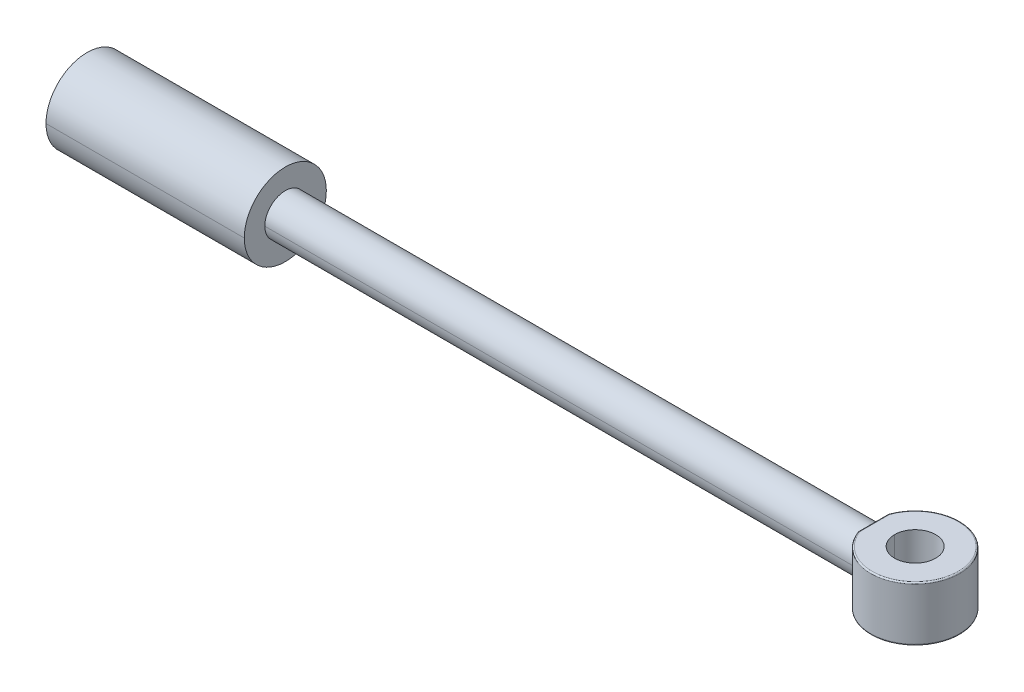
ISO-10303-21;
HEADER;
FILE_DESCRIPTION(('STEP AP214'),'2;1');
FILE_NAME('part.step','',(''),(''),'','','');
FILE_SCHEMA(('AUTOMOTIVE_DESIGN { 1 0 10303 214 1 1 1 1 }'));
ENDSEC;
DATA;
#1=APPLICATION_CONTEXT('core data for automotive mechanical design processes');
#2=APPLICATION_PROTOCOL_DEFINITION('international standard','automotive_design',2000,#1);
#3=PRODUCT_CONTEXT('',#1,'mechanical');
#4=PRODUCT('Part','Part','',(#3));
#5=PRODUCT_RELATED_PRODUCT_CATEGORY('part','',(#4));
#6=PRODUCT_DEFINITION_FORMATION('','',#4);
#7=PRODUCT_DEFINITION_CONTEXT('part definition',#1,'design');
#8=PRODUCT_DEFINITION('design','',#6,#7);
#9=PRODUCT_DEFINITION_SHAPE('','',#8);
#10=(LENGTH_UNIT() NAMED_UNIT(*) SI_UNIT(.MILLI.,.METRE.));
#11=(NAMED_UNIT(*) PLANE_ANGLE_UNIT() SI_UNIT($,.RADIAN.));
#12=(NAMED_UNIT(*) SI_UNIT($,.STERADIAN.) SOLID_ANGLE_UNIT());
#13=UNCERTAINTY_MEASURE_WITH_UNIT(LENGTH_MEASURE(1.E-05),#10,'distance_accuracy_value','');
#14=(GEOMETRIC_REPRESENTATION_CONTEXT(3) GLOBAL_UNCERTAINTY_ASSIGNED_CONTEXT((#13)) GLOBAL_UNIT_ASSIGNED_CONTEXT((#10,
#11,#12)) REPRESENTATION_CONTEXT('',''));
#15=CARTESIAN_POINT('',(0.,0.,0.));
#16=DIRECTION('',(0.,0.,1.));
#17=DIRECTION('',(1.,0.,0.));
#18=AXIS2_PLACEMENT_3D('',#15,#16,#17);
#19=CARTESIAN_POINT('',(-28.75,0.,0.));
#20=DIRECTION('',(-1.,0.,0.));
#21=DIRECTION('',(0.,0.,1.));
#22=AXIS2_PLACEMENT_3D('',#19,#20,#21);
#23=CYLINDRICAL_SURFACE('',#22,15.);
#24=CARTESIAN_POINT('',(145.,0.,0.));
#25=DIRECTION('',(1.,0.,0.));
#26=DIRECTION('',(0.,0.,-1.));
#27=AXIS2_PLACEMENT_3D('',#24,#25,#26);
#28=CIRCLE('',#27,15.);
#29=CARTESIAN_POINT('',(145.,0.,-15.));
#30=VERTEX_POINT('',#29);
#31=CARTESIAN_POINT('',(145.,0.,15.));
#32=VERTEX_POINT('',#31);
#33=EDGE_CURVE('E11',#30,#32,#28,.T.);
#34=ORIENTED_EDGE('',*,*,#33,.T.);
#35=DIRECTION('',(-1.,0.,0.));
#36=VECTOR('',#35,1.);
#37=CARTESIAN_POINT('',(575.,0.,15.));
#38=LINE('',#37,#36);
#39=CARTESIAN_POINT('',(575.,0.,15.));
#40=VERTEX_POINT('',#39);
#41=EDGE_CURVE('E36',#40,#32,#38,.T.);
#42=ORIENTED_EDGE('',*,*,#41,.F.);
#43=CARTESIAN_POINT('',(575.,0.,0.));
#44=DIRECTION('',(1.,0.,0.));
#45=DIRECTION('',(0.,0.,1.));
#46=AXIS2_PLACEMENT_3D('',#43,#44,#45);
#47=CIRCLE('',#46,15.);
#48=CARTESIAN_POINT('',(575.015079365079,-10.2095472140301,10.9887787441043));
#49=VERTEX_POINT('',#48);
#50=EDGE_CURVE('E27',#40,#49,#47,.T.);
#51=ORIENTED_EDGE('',*,*,#50,.T.);
#52=CARTESIAN_POINT('',(575.018438811269,10.1986326040488,11.0008233900868));
#53=CARTESIAN_POINT('',(575.075798920642,10.0274698699406,11.1602881987124));
#54=CARTESIAN_POINT('',(575.133137902024,9.85256924967932,11.3157633117448));
#55=CARTESIAN_POINT('',(575.246745966509,9.49701994937464,11.6170401892811));
#56=CARTESIAN_POINT('',(575.303020008204,9.31643345842196,11.7629135017409));
#57=CARTESIAN_POINT('',(575.414104751249,8.9495126168481,12.045106227894));
#58=CARTESIAN_POINT('',(575.468922666446,8.76322414862832,12.1814824182651));
#59=CARTESIAN_POINT('',(575.576730564212,8.38492059894139,12.4448158253612));
#60=CARTESIAN_POINT('',(575.62972773582,8.19293546825972,12.5718131170147));
#61=CARTESIAN_POINT('',(575.733557070786,7.80325296608626,12.816521112503));
#62=CARTESIAN_POINT('',(575.784394198618,7.60557066631598,12.9342537075953));
#63=CARTESIAN_POINT('',(575.883595832953,7.20451077451255,13.1605693253251));
#64=CARTESIAN_POINT('',(575.931961043149,7.00113482912161,13.2691549576417));
#65=CARTESIAN_POINT('',(576.025931121516,6.58869410358599,13.4772963825114));
#66=CARTESIAN_POINT('',(576.071530645685,6.37961937467375,13.5768348677401));
#67=CARTESIAN_POINT('',(576.159734174569,5.95581739838218,13.7670542388325));
#68=CARTESIAN_POINT('',(576.202325415078,5.74107082396903,13.8576979507668));
#69=CARTESIAN_POINT('',(576.285071287346,5.30122950259649,14.0319097920815));
#70=CARTESIAN_POINT('',(576.32512736043,5.07601238549925,14.1152164537577));
#71=CARTESIAN_POINT('',(576.400396803402,4.62396840867151,14.27026709777));
#72=CARTESIAN_POINT('',(576.435663201343,4.39719454204586,14.3421395211247));
#73=CARTESIAN_POINT('',(576.501133006099,3.94207707737367,14.4745064388244));
#74=CARTESIAN_POINT('',(576.531382566648,3.71377053676567,14.5351053595846));
#75=CARTESIAN_POINT('',(576.586613067861,3.25559753701131,14.6450380435408));
#76=CARTESIAN_POINT('',(576.611630534816,3.02575430582071,14.6944501192635));
#77=CARTESIAN_POINT('',(576.656240057104,2.56452331975277,14.7821233295087));
#78=CARTESIAN_POINT('',(576.67585634319,2.33314739493436,14.82043430768));
#79=CARTESIAN_POINT('',(576.709545546693,1.86886180753317,14.8860001024671));
#80=CARTESIAN_POINT('',(576.723628428401,1.63595567688543,14.9132747953668));
#81=CARTESIAN_POINT('',(576.746172195411,1.16861727056746,14.9568453916648));
#82=CARTESIAN_POINT('',(576.754627548025,0.934183721139947,14.9731304908948));
#83=CARTESIAN_POINT('',(576.765878561865,0.463795941617146,14.9947854289824));
#84=CARTESIAN_POINT('',(576.768652800798,0.227839309038401,15.0001139531939));
#85=CARTESIAN_POINT('',(576.768531974112,-0.243900107829193,14.9998817187552));
#86=CARTESIAN_POINT('',(576.765640926716,-0.479682896763271,14.9943286780833));
#87=CARTESIAN_POINT('',(576.754153011372,-0.949756441982427,14.972216479084));
#88=CARTESIAN_POINT('',(576.745576433151,-1.18404952360615,14.9556964578824));
#89=CARTESIAN_POINT('',(576.722791837089,-1.65114069512522,14.911655246294));
#90=CARTESIAN_POINT('',(576.708588190029,-1.8839398031702,14.8841425942037));
#91=CARTESIAN_POINT('',(576.67465885847,-2.34804522188321,14.8180976940989));
#92=CARTESIAN_POINT('',(576.654922078424,-2.57934756763726,14.7795433007817));
#93=CARTESIAN_POINT('',(576.610074030993,-3.04046540050818,14.6913800684913));
#94=CARTESIAN_POINT('',(576.584937478118,-3.27026846244826,14.6417191745752));
#95=CARTESIAN_POINT('',(576.529472222423,-3.72839549253074,14.5312854652698));
#96=CARTESIAN_POINT('',(576.499106055375,-3.95669550542119,14.4704322394598));
#97=CARTESIAN_POINT('',(576.433406496685,-4.41183363102603,14.3375511518726));
#98=CARTESIAN_POINT('',(576.398026154575,-4.63863385803879,14.2654169099561));
#99=CARTESIAN_POINT('',(576.32253613117,-5.09076730271133,14.109842832453));
#100=CARTESIAN_POINT('',(576.282372826069,-5.31604667976751,14.0262728608104));
#101=CARTESIAN_POINT('',(576.199461666468,-5.75578037465077,13.8516224323595));
#102=CARTESIAN_POINT('',(576.156815784953,-5.97036184031047,13.7608130378694));
#103=CARTESIAN_POINT('',(576.068501699319,-6.39384242984147,13.5702466258172));
#104=CARTESIAN_POINT('',(576.022845911494,-6.60276042786405,13.4705258293378));
#105=CARTESIAN_POINT('',(575.928765774727,-7.01489969305625,13.2620101946963));
#106=CARTESIAN_POINT('',(575.880346445324,-7.21813034855356,13.1532316532706));
#107=CARTESIAN_POINT('',(575.781039045723,-7.61891093771196,12.9265187741344));
#108=CARTESIAN_POINT('',(575.730150001187,-7.81645857958032,12.8085808117078));
#109=CARTESIAN_POINT('',(575.626220365308,-8.20588334404369,12.5634508842878));
#110=CARTESIAN_POINT('',(575.573174605357,-8.39774467611243,12.4362360287037));
#111=CARTESIAN_POINT('',(575.465273895591,-8.77581221831775,12.1724559657881));
#112=CARTESIAN_POINT('',(575.410411630418,-8.96198770245309,12.0358497218362));
#113=CARTESIAN_POINT('',(575.299243542481,-9.32869422807096,11.7531852215973));
#114=CARTESIAN_POINT('',(575.242930465757,-9.50917857527334,11.6070692842641));
#115=CARTESIAN_POINT('',(575.129250593602,-9.86453528355088,11.3052951869491));
#116=CARTESIAN_POINT('',(575.071878888906,-10.0393446310425,11.149564647575));
#117=CARTESIAN_POINT('',(575.014492974546,-10.2104136573085,10.9898480424391));
#118=B_SPLINE_CURVE_WITH_KNOTS('',3,(#52,#53,#54,#55,#56,#57,#58,#59,#60,#61,#62,#63,#64,#65,
#66,#67,#68,#69,#70,#71,#72,#73,#74,#75,#76,#77,#78,#79,#80,#81,#82,#83,#84,#85,#86,#87,#88,#89,
#90,#91,#92,#93,#94,#95,#96,#97,#98,#99,#100,#101,#102,#103,#104,#105,#106,#107,#108,#109,#110,
#111,#112,#113,#114,#115,#116,#117),.UNSPECIFIED.,.F.,.F.,(4,2,2,2,2,2,2,2,2,2,2,2,2,2,2,2,2,2,
2,2,2,2,2,2,2,2,2,2,2,2,2,2,4),(0.,0.722547232320676,1.43889540713049,2.15050862212376,
2.85888034840113,3.56552462237561,4.27196659912319,4.97973275247182,5.69034103291579,
6.42039312866351,7.14155576841832,7.85566364752814,8.56460625012201,9.27031456303919,
9.97474618112489,10.6798693400554,11.3876465112472,12.0949218583278,12.7996866708127,
13.5039051328269,14.2095459858414,14.9185661152179,15.6328946245843,16.354418028223,
17.0849670893348,17.7953462076839,18.5029589571285,19.2093249921998,19.9159720005009,
20.6244258409789,21.3362007407592,22.0527898615119,22.775656519347),.UNSPECIFIED.);
#119=CARTESIAN_POINT('',(575.020365569891,10.1979308562441,10.9994214652227));
#120=VERTEX_POINT('',#119);
#121=EDGE_CURVE('E206',#120,#49,#118,.T.);
#122=ORIENTED_EDGE('',*,*,#121,.F.);
#123=CARTESIAN_POINT('',(574.993550747816,10.2003028953208,10.9979007471295));
#124=CARTESIAN_POINT('',(574.993819466657,10.2102237914417,10.9886993416038));
#125=CARTESIAN_POINT('',(574.994088185498,10.2201322370056,10.9794845119682));
#126=CARTESIAN_POINT('',(574.99462562318,10.2399241545978,10.9610280721172));
#127=CARTESIAN_POINT('',(574.994894342021,10.2498076266261,10.9517864619019));
#128=CARTESIAN_POINT('',(574.995431779703,10.2695495247259,10.933276528532));
#129=CARTESIAN_POINT('',(574.995700498544,10.2794079507975,10.9240082053773));
#130=CARTESIAN_POINT('',(574.996237936226,10.2990996847952,10.9054449140175));
#131=CARTESIAN_POINT('',(574.996506655067,10.3089329927214,10.8961499458122));
#132=CARTESIAN_POINT('',(574.997044092749,10.3285744184096,10.8775334324201));
#133=CARTESIAN_POINT('',(574.99731281159,10.3383825361717,10.8682118872332));
#134=CARTESIAN_POINT('',(574.997850249272,10.3579735097047,10.8495422881486));
#135=CARTESIAN_POINT('',(574.998118968113,10.3677563654755,10.840194234251));
#136=CARTESIAN_POINT('',(574.998656405795,10.3872967433696,10.8214716861952));
#137=CARTESIAN_POINT('',(574.998925124636,10.3970542654928,10.812097192037));
#138=CARTESIAN_POINT('',(574.999462562318,10.4165439046708,10.793321832156));
#139=CARTESIAN_POINT('',(574.999731281159,10.4262760217256,10.7839209664332));
#140=CARTESIAN_POINT('',(575.,10.4359954005357,10.7745069492761));
#141=B_SPLINE_CURVE_WITH_KNOTS('',3,(#123,#124,#125,#126,#127,#128,#129,#130,#131,#132,#133,
#134,#135,#136,#137,#138,#139,#140),.UNSPECIFIED.,.F.,.F.,(4,2,2,2,2,2,2,2,4),(0.,
0.0406012225685691,0.0812024451371394,0.121803667705709,0.162404890274281,0.203006112842847,
0.243607335411421,0.284208557979989,0.324809780548557),.UNSPECIFIED.);
#142=CARTESIAN_POINT('',(575.,10.4359954005357,10.7745069492761));
#143=VERTEX_POINT('',#142);
#144=EDGE_CURVE('E194',#120,#143,#141,.T.);
#145=ORIENTED_EDGE('',*,*,#144,.T.);
#146=CARTESIAN_POINT('',(575.,0.,0.));
#147=DIRECTION('',(1.,0.,0.));
#148=DIRECTION('',(0.,0.69573302670237,-0.718300463285079));
#149=AXIS2_PLACEMENT_3D('',#146,#147,#148);
#150=CIRCLE('',#149,15.);
#151=CARTESIAN_POINT('',(575.,10.4359954005356,-10.7745069492762));
#152=VERTEX_POINT('',#151);
#153=EDGE_CURVE('E529',#152,#143,#150,.T.);
#154=ORIENTED_EDGE('',*,*,#153,.F.);
#155=CARTESIAN_POINT('',(575.,10.4359954005356,-10.7745069492762));
#156=CARTESIAN_POINT('',(574.999735460043,10.4262750687961,-10.7839218894237));
#157=CARTESIAN_POINT('',(574.999470920087,10.4165419963141,-10.7933236755579));
#158=CARTESIAN_POINT('',(574.998941840174,10.3970504413067,-10.8121008710834));
#159=CARTESIAN_POINT('',(574.998677300217,10.3872919587814,-10.8214762804748));
#160=CARTESIAN_POINT('',(574.998148220304,10.3677496551292,-10.8402006537988));
#161=CARTESIAN_POINT('',(574.997883680348,10.3579658340023,-10.8495496177313));
#162=CARTESIAN_POINT('',(574.997354600434,10.3383729248247,-10.8682210316672));
#163=CARTESIAN_POINT('',(574.997090060478,10.3285638367738,-10.8775434816706));
#164=CARTESIAN_POINT('',(574.996560980565,10.3089204655966,-10.8961617994572));
#165=CARTESIAN_POINT('',(574.996296440608,10.2990861824702,-10.9054576672404));
#166=CARTESIAN_POINT('',(574.995767360695,10.2793924931817,-10.924022752498));
#167=CARTESIAN_POINT('',(574.995502820739,10.2695330870196,-10.9332919699723));
#168=CARTESIAN_POINT('',(574.994973740826,10.2497892238698,-10.9518036867033));
#169=CARTESIAN_POINT('',(574.994709200869,10.239904766882,-10.96104618596));
#170=CARTESIAN_POINT('',(574.994180120956,10.2201108745234,-10.9795043985957));
#171=CARTESIAN_POINT('',(574.993915581,10.2102014391525,-10.9887201119748));
#172=CARTESIAN_POINT('',(574.993651041043,10.2002795508116,-10.9979223985849));
#173=B_SPLINE_CURVE_WITH_KNOTS('',3,(#155,#156,#157,#158,#159,#160,#161,#162,#163,#164,#165,
#166,#167,#168,#169,#170,#171,#172),.UNSPECIFIED.,.F.,.F.,(4,2,2,2,2,2,2,2,4),(0.,
0.0406049547514714,0.0812099095029353,0.121814864254403,0.162419819005873,0.203024773757346,
0.243629728508811,0.284234683260274,0.324839638011747),.UNSPECIFIED.);
#174=CARTESIAN_POINT('',(575.020359721503,10.1979492806169,-10.9994041848943));
#175=VERTEX_POINT('',#174);
#176=EDGE_CURVE('E551',#152,#175,#173,.T.);
#177=ORIENTED_EDGE('',*,*,#176,.T.);
#178=CARTESIAN_POINT('',(575.014492971981,-10.2104136699001,-10.9898480353015));
#179=CARTESIAN_POINT('',(575.071861044432,-10.0393979655175,-11.1495149115602));
#180=CARTESIAN_POINT('',(575.129213915992,-9.86464164775684,-11.3051955581388));
#181=CARTESIAN_POINT('',(575.242860310329,-9.50937632586071,-11.6068852891668));
#182=CARTESIAN_POINT('',(575.299158701472,-9.32892969402112,-11.7529660143182));
#183=CARTESIAN_POINT('',(575.410302312399,-8.96228394447726,-12.0355752184874));
#184=CARTESIAN_POINT('',(575.465154691416,-8.77613089080407,-12.1721606012603));
#185=CARTESIAN_POINT('',(575.573041235003,-8.3980935441869,-12.4359139078837));
#186=CARTESIAN_POINT('',(575.626082571068,-8.20623937506251,-12.5631220655913));
#187=CARTESIAN_POINT('',(575.730009512419,-7.81681418982015,-12.8082532492625));
#188=CARTESIAN_POINT('',(575.780900101246,-7.61925840319127,-12.9261983533644));
#189=CARTESIAN_POINT('',(575.880217430163,-7.21844691441235,-13.1529403285798));
#190=CARTESIAN_POINT('',(575.928644927811,-7.01519299500453,-13.2617400192971));
#191=CARTESIAN_POINT('',(576.022748015833,-6.60299184969415,-13.4703111916504));
#192=CARTESIAN_POINT('',(576.068418347921,-6.39403478425728,-13.5700655938582));
#193=CARTESIAN_POINT('',(576.156770916229,-5.97046321239213,-13.7607173960627));
#194=CARTESIAN_POINT('',(576.199440498567,-5.75582945427097,-13.8515778561309));
#195=CARTESIAN_POINT('',(576.282360076518,-5.31617926814996,-14.0262459903751));
#196=CARTESIAN_POINT('',(576.322511296914,-5.09103962388304,-14.1097910813475));
#197=CARTESIAN_POINT('',(576.397979171616,-4.63914461964913,-14.2653206495481));
#198=CARTESIAN_POINT('',(576.433348832696,-4.41244248336538,-14.3374337343151));
#199=CARTESIAN_POINT('',(576.49903194688,-3.95746204574349,-14.4702831301528));
#200=CARTESIAN_POINT('',(576.529391595226,-3.72922102031153,-14.5311241021955));
#201=CARTESIAN_POINT('',(576.584848376433,-3.27117276048034,-14.6415425923858));
#202=CARTESIAN_POINT('',(576.609982129836,-3.0413889418421,-14.6911987084264));
#203=CARTESIAN_POINT('',(576.654829460471,-2.58027049079086,-14.7793619236659));
#204=CARTESIAN_POINT('',(576.674567410555,-2.34894783448782,-14.8179191996588));
#205=CARTESIAN_POINT('',(576.708504335167,-1.88476254868223,-14.8839798513884));
#206=CARTESIAN_POINT('',(576.722713454462,-1.65190354459442,-14.9115034754397));
#207=CARTESIAN_POINT('',(576.745513267219,-1.184653206592,-14.955574623076));
#208=CARTESIAN_POINT('',(576.754098635108,-0.950260631902926,-14.9721117428837));
#209=CARTESIAN_POINT('',(576.765612265983,-0.479948690325147,-14.994273582453));
#210=CARTESIAN_POINT('',(576.768519326434,-0.244026888889932,-14.9998574034349));
#211=CARTESIAN_POINT('',(576.768665378013,0.227713023408746,-15.0001381330774));
#212=CARTESIAN_POINT('',(576.765907064237,0.463531130222608,-14.9948402183283));
#213=CARTESIAN_POINT('',(576.754681587392,0.933681494474651,-14.9732345697922));
#214=CARTESIAN_POINT('',(576.746234933977,1.16801604760952,-14.9569663896852));
#215=CARTESIAN_POINT('',(576.723706201157,1.63519627801224,-14.9134253630316));
#216=CARTESIAN_POINT('',(576.70962869915,1.86804300892834,-14.8861614549214));
#217=CARTESIAN_POINT('',(576.675946902578,2.33224972161164,-14.8206110304127));
#218=CARTESIAN_POINT('',(576.656331691992,2.56360583435821,-14.7823027399556));
#219=CARTESIAN_POINT('',(576.611721263345,3.02483719844096,-14.6946291162055));
#220=CARTESIAN_POINT('',(576.5867009005,3.25470017281357,-14.6452120597544));
#221=CARTESIAN_POINT('',(576.531461732372,3.7129529419965,-14.5352637452768));
#222=CARTESIAN_POINT('',(576.501205555366,3.94131897113858,-14.4746523603604));
#223=CARTESIAN_POINT('',(576.435719110625,4.39659512698047,-14.3422533234426));
#224=CARTESIAN_POINT('',(576.400441931987,4.62346758783022,-14.2703595237669));
#225=CARTESIAN_POINT('',(576.325150144932,5.07575100858834,-14.1152639299438));
#226=CARTESIAN_POINT('',(576.28508188926,5.30110835918759,-14.0319321637177));
#227=CARTESIAN_POINT('',(576.20234416498,5.74103401069516,-13.8577373772805));
#228=CARTESIAN_POINT('',(576.1597764622,5.95572860703528,-13.7671443118638));
#229=CARTESIAN_POINT('',(576.071611085868,6.37944022098084,-13.5770094630234));
#230=CARTESIAN_POINT('',(576.026025938385,6.58847618904505,-13.4775041347859));
#231=CARTESIAN_POINT('',(575.932078477334,7.00085563464446,-13.2694173261842));
#232=CARTESIAN_POINT('',(575.883721268187,7.20420861049802,-13.1608523700112));
#233=CARTESIAN_POINT('',(575.784529230208,7.60523817978487,-12.9345648766895));
#234=CARTESIAN_POINT('',(575.73369347997,7.80291261813059,-12.8168389240663));
#235=CARTESIAN_POINT('',(575.62986112015,8.19259525441808,-12.5721311613799));
#236=CARTESIAN_POINT('',(575.576859359996,8.38458781997445,-12.4451266466335));
#237=CARTESIAN_POINT('',(575.469036971207,8.76292209768015,-12.1817654076002));
#238=CARTESIAN_POINT('',(575.414209008597,8.94923325698232,-12.0453678044186));
#239=CARTESIAN_POINT('',(575.303099472142,9.31621538458821,-11.7631186535696));
#240=CARTESIAN_POINT('',(575.246810588659,9.49683984008973,-11.6172095505448));
#241=CARTESIAN_POINT('',(575.133168741663,9.85248101448555,-11.3158471244177));
#242=CARTESIAN_POINT('',(575.075810777666,10.0274349025869,-11.1603215131601));
#243=CARTESIAN_POINT('',(575.018432684784,10.1986511757492,-11.00080635885));
#244=B_SPLINE_CURVE_WITH_KNOTS('',3,(#178,#179,#180,#181,#182,#183,#184,#185,#186,#187,#188,
#189,#190,#191,#192,#193,#194,#195,#196,#197,#198,#199,#200,#201,#202,#203,#204,#205,#206,#207,
#208,#209,#210,#211,#212,#213,#214,#215,#216,#217,#218,#219,#220,#221,#222,#223,#224,#225,#226,
#227,#228,#229,#230,#231,#232,#233,#234,#235,#236,#237,#238,#239,#240,#241,#242,#243),
.UNSPECIFIED.,.F.,.F.,(4,2,2,2,2,2,2,2,2,2,2,2,2,2,2,2,2,2,2,2,2,2,2,2,2,2,2,2,2,2,2,2,4),(0.,
0.722641240750864,1.43906989434457,2.15074922626082,2.85917194557955,3.56585141102314,
4.27231219626147,4.98008029908719,5.69067330505478,6.4208028046586,7.14202450180628,
7.85617139752339,8.56513138518344,9.2708339999306,9.97523555579767,10.6803032043847,
11.3879985478047,12.0953573088607,12.8001792034673,13.504429298915,14.2100774345038,
14.9190817895613,15.6333729315272,16.3548389761726,17.0853123901415,17.7957082984309,
18.503320622562,19.2096693925344,19.9162827824699,20.6246872429627,21.3363976886404,
22.0529080524105,22.7756824910864),.UNSPECIFIED.);
#245=CARTESIAN_POINT('',(575.015079365079,-10.2095472245113,-10.9887787342717));
#246=VERTEX_POINT('',#245);
#247=EDGE_CURVE('E164',#246,#175,#244,.T.);
#248=ORIENTED_EDGE('',*,*,#247,.F.);
#249=CARTESIAN_POINT('',(575.,0.,0.));
#250=DIRECTION('',(1.,0.,0.));
#251=DIRECTION('',(0.,-0.683487787422394,-0.729961947257828));
#252=AXIS2_PLACEMENT_3D('',#249,#250,#251);
#253=CIRCLE('',#252,15.);
#254=CARTESIAN_POINT('',(575.,0.,-15.));
#255=VERTEX_POINT('',#254);
#256=EDGE_CURVE('E102',#246,#255,#253,.T.);
#257=ORIENTED_EDGE('',*,*,#256,.T.);
#258=DIRECTION('',(-1.,0.,0.));
#259=VECTOR('',#258,1.);
#260=CARTESIAN_POINT('',(575.,0.,-15.));
#261=LINE('',#260,#259);
#262=EDGE_CURVE('E98',#255,#30,#261,.T.);
#263=ORIENTED_EDGE('',*,*,#262,.T.);
#264=EDGE_LOOP('',(#34,#42,#51,#122,#145,#154,#177,#248,#257,#263));
#265=FACE_BOUND('',#264,.T.);
#266=ADVANCED_FACE('F16',(#265),#23,.T.);
#267=CARTESIAN_POINT('',(145.,0.,0.));
#268=DIRECTION('',(1.,0.,0.));
#269=DIRECTION('',(0.,0.,1.));
#270=AXIS2_PLACEMENT_3D('',#267,#268,#269);
#271=PLANE('',#270);
#272=CARTESIAN_POINT('',(145.,0.,0.));
#273=DIRECTION('',(1.,0.,0.));
#274=DIRECTION('',(0.,0.,-1.));
#275=AXIS2_PLACEMENT_3D('',#272,#273,#274);
#276=CIRCLE('',#275,30.);
#277=CARTESIAN_POINT('',(145.,0.,-30.));
#278=VERTEX_POINT('',#277);
#279=CARTESIAN_POINT('',(145.,0.,30.));
#280=VERTEX_POINT('',#279);
#281=EDGE_CURVE('E104',#278,#280,#276,.T.);
#282=ORIENTED_EDGE('',*,*,#281,.T.);
#283=CARTESIAN_POINT('',(145.,0.,0.));
#284=DIRECTION('',(-1.,0.,0.));
#285=DIRECTION('',(0.,0.,-1.));
#286=AXIS2_PLACEMENT_3D('',#283,#284,#285);
#287=CIRCLE('',#286,30.);
#288=EDGE_CURVE('E147',#278,#280,#287,.T.);
#289=ORIENTED_EDGE('',*,*,#288,.F.);
#290=EDGE_LOOP('',(#282,#289));
#291=FACE_BOUND('',#290,.T.);
#292=CARTESIAN_POINT('',(145.,0.,0.));
#293=DIRECTION('',(-1.,0.,0.));
#294=DIRECTION('',(0.,0.,-1.));
#295=AXIS2_PLACEMENT_3D('',#292,#293,#294);
#296=CIRCLE('',#295,15.);
#297=EDGE_CURVE('E108',#30,#32,#296,.T.);
#298=ORIENTED_EDGE('',*,*,#297,.T.);
#299=ORIENTED_EDGE('',*,*,#33,.F.);
#300=EDGE_LOOP('',(#298,#299));
#301=FACE_BOUND('',#300,.T.);
#302=ADVANCED_FACE('F107',(#291,#301),#271,.T.);
#303=CARTESIAN_POINT('',(-28.75,0.,0.));
#304=DIRECTION('',(-1.,0.,0.));
#305=DIRECTION('',(0.,0.,1.));
#306=AXIS2_PLACEMENT_3D('',#303,#304,#305);
#307=CYLINDRICAL_SURFACE('',#306,15.);
#308=ORIENTED_EDGE('',*,*,#41,.T.);
#309=ORIENTED_EDGE('',*,*,#297,.F.);
#310=ORIENTED_EDGE('',*,*,#262,.F.);
#311=ORIENTED_EDGE('',*,*,#256,.F.);
#312=CARTESIAN_POINT('',(574.99580516715,-10.2110589906437,-10.9879149200199));
#313=CARTESIAN_POINT('',(574.995979951852,-10.2205229117798,-10.9791201070724));
#314=CARTESIAN_POINT('',(574.996154736554,-10.2299754703678,-10.9703130671159));
#315=CARTESIAN_POINT('',(574.996504305958,-10.2488577994563,-10.952674592114));
#316=CARTESIAN_POINT('',(574.99667909066,-10.258287569957,-10.9438431570687));
#317=CARTESIAN_POINT('',(574.997028660065,-10.2771242598802,-10.9261559508185));
#318=CARTESIAN_POINT('',(574.997203444767,-10.2865311793028,-10.9173001796136));
#319=CARTESIAN_POINT('',(574.997553014171,-10.3053221042726,-10.8995643601801));
#320=CARTESIAN_POINT('',(574.997727798873,-10.3147061098198,-10.8906843119514));
#321=CARTESIAN_POINT('',(574.998077368277,-10.333451144383,-10.8728999977553));
#322=CARTESIAN_POINT('',(574.998252152979,-10.342812173399,-10.8639957317879));
#323=CARTESIAN_POINT('',(574.998601722383,-10.3615111924029,-10.8461630415677));
#324=CARTESIAN_POINT('',(574.998776507085,-10.3708491823909,-10.8372346173148));
#325=CARTESIAN_POINT('',(574.99912607649,-10.3895020609841,-10.8193536701255));
#326=CARTESIAN_POINT('',(574.999300861192,-10.3988169495894,-10.8104011471892));
#327=CARTESIAN_POINT('',(574.999650430596,-10.4174235632584,-10.7924720624391));
#328=CARTESIAN_POINT('',(574.999825215298,-10.4267152883221,-10.7834955006254));
#329=CARTESIAN_POINT('',(575.,-10.4359954005355,-10.7745069492762));
#330=B_SPLINE_CURVE_WITH_KNOTS('',3,(#312,#313,#314,#315,#316,#317,#318,#319,#320,#321,#322,
#323,#324,#325,#326,#327,#328,#329),.UNSPECIFIED.,.F.,.F.,(4,2,2,2,2,2,2,2,4),(0.,
0.0387621587874903,0.0775243175749831,0.11628647636248,0.155048635149971,0.19381079393746,
0.232572952724959,0.271335111512449,0.310097270299941),.UNSPECIFIED.);
#331=CARTESIAN_POINT('',(575.,-10.4359954005356,-10.7745069492762));
#332=VERTEX_POINT('',#331);
#333=EDGE_CURVE('E120',#246,#332,#330,.T.);
#334=ORIENTED_EDGE('',*,*,#333,.T.);
#335=CARTESIAN_POINT('',(575.,0.,0.));
#336=DIRECTION('',(1.,0.,0.));
#337=DIRECTION('',(0.,-0.695733026702379,0.718300463285071));
#338=AXIS2_PLACEMENT_3D('',#335,#336,#337);
#339=CIRCLE('',#338,15.);
#340=CARTESIAN_POINT('',(575.,-10.4359954005357,10.7745069492761));
#341=VERTEX_POINT('',#340);
#342=EDGE_CURVE('E338',#341,#332,#339,.T.);
#343=ORIENTED_EDGE('',*,*,#342,.F.);
#344=CARTESIAN_POINT('',(575.,-10.4359954005357,10.774506949276));
#345=CARTESIAN_POINT('',(574.999821941303,-10.4267164833092,10.7834943431821));
#346=CARTESIAN_POINT('',(574.999643882606,-10.4174259562231,10.7924697506402));
#347=CARTESIAN_POINT('',(574.999287765211,-10.3988217444664,10.8103965328773));
#348=CARTESIAN_POINT('',(574.999109706514,-10.3895080597957,10.8193479076563));
#349=CARTESIAN_POINT('',(574.99875358912,-10.3708575950049,10.8372265647522));
#350=CARTESIAN_POINT('',(574.998575530423,-10.3615208148846,10.846153847069));
#351=CARTESIAN_POINT('',(574.998219413029,-10.342824221525,10.8639842596613));
#352=CARTESIAN_POINT('',(574.998041354332,-10.3334644082857,10.8728873899368));
#353=CARTESIAN_POINT('',(574.997685236937,-10.3147218111605,10.8906694390164));
#354=CARTESIAN_POINT('',(574.99750717824,-10.3053390272746,10.8995483578204));
#355=CARTESIAN_POINT('',(574.997151060846,-10.2865505514878,10.9172819246945));
#356=CARTESIAN_POINT('',(574.996973002149,-10.277144859587,10.9261365727646));
#357=CARTESIAN_POINT('',(574.996616884755,-10.2583106305434,10.9438215390579));
#358=CARTESIAN_POINT('',(574.996438826057,-10.2488820934006,10.9526518572812));
#359=CARTESIAN_POINT('',(574.996082708663,-10.2300022368393,10.9702881049742));
#360=CARTESIAN_POINT('',(574.995904649966,-10.2205509174208,10.979094034444));
#361=CARTESIAN_POINT('',(574.995726591269,-10.2110882383475,10.9878877400836));
#362=B_SPLINE_CURVE_WITH_KNOTS('',3,(#344,#345,#346,#347,#348,#349,#350,#351,#352,#353,#354,
#355,#356,#357,#358,#359,#360,#361),.UNSPECIFIED.,.F.,.F.,(4,2,2,2,2,2,2,2,4),(0.,
0.0387573024830536,0.0775146049661085,0.116271907449148,0.155029209932202,0.193786512415256,
0.232543814898294,0.271301117381351,0.310058419864402),.UNSPECIFIED.);
#363=EDGE_CURVE('E200',#341,#49,#362,.T.);
#364=ORIENTED_EDGE('',*,*,#363,.T.);
#365=ORIENTED_EDGE('',*,*,#50,.F.);
#366=EDGE_LOOP('',(#308,#309,#310,#311,#334,#343,#364,#365));
#367=FACE_BOUND('',#366,.T.);
#368=ADVANCED_FACE('F109',(#367),#307,.T.);
#369=CARTESIAN_POINT('',(605.6,-20.,0.));
#370=DIRECTION('',(0.,-1.,0.));
#371=DIRECTION('',(1.,0.,0.));
#372=AXIS2_PLACEMENT_3D('',#369,#370,#371);
#373=CYLINDRICAL_SURFACE('',#372,32.5);
#374=DIRECTION('',(0.,-1.,0.));
#375=VECTOR('',#374,1.);
#376=CARTESIAN_POINT('',(575.060317460318,-10.0708594283006,11.1165547889357));
#377=LINE('',#376,#375);
#378=CARTESIAN_POINT('',(575.060317460318,-19.,11.1165547889355));
#379=VERTEX_POINT('',#378);
#380=EDGE_CURVE('E163',#49,#379,#377,.T.);
#381=ORIENTED_EDGE('',*,*,#380,.T.);
#382=CARTESIAN_POINT('',(605.6,-19.,0.));
#383=DIRECTION('',(0.,1.,0.));
#384=DIRECTION('',(-0.939682539682541,0.,0.342047839659557));
#385=AXIS2_PLACEMENT_3D('',#382,#383,#384);
#386=CIRCLE('',#385,32.5);
#387=CARTESIAN_POINT('',(575.060317460318,-19.,-11.1165547889356));
#388=VERTEX_POINT('',#387);
#389=EDGE_CURVE('E160',#379,#388,#386,.T.);
#390=ORIENTED_EDGE('',*,*,#389,.T.);
#391=DIRECTION('',(0.,-1.,0.));
#392=VECTOR('',#391,1.);
#393=CARTESIAN_POINT('',(575.060317460317,-10.0708594283008,-11.1165547889355));
#394=LINE('',#393,#392);
#395=EDGE_CURVE('E343',#246,#388,#394,.T.);
#396=ORIENTED_EDGE('',*,*,#395,.F.);
#397=ORIENTED_EDGE('',*,*,#247,.T.);
#398=DIRECTION('',(0.,-1.,0.));
#399=VECTOR('',#398,1.);
#400=CARTESIAN_POINT('',(575.060317460318,19.,-11.1165547889356));
#401=LINE('',#400,#399);
#402=CARTESIAN_POINT('',(575.060317460318,19.,-11.1165547889356));
#403=VERTEX_POINT('',#402);
#404=EDGE_CURVE('E145',#403,#175,#401,.T.);
#405=ORIENTED_EDGE('',*,*,#404,.F.);
#406=CARTESIAN_POINT('',(605.6,19.,2.60236276972137E-13));
#407=DIRECTION('',(0.,-1.,0.));
#408=DIRECTION('',(-0.939682539682538,0.,-0.342047839659566));
#409=AXIS2_PLACEMENT_3D('',#406,#407,#408);
#410=CIRCLE('',#409,32.5);
#411=CARTESIAN_POINT('',(575.060317460318,19.,11.1165547889355));
#412=VERTEX_POINT('',#411);
#413=EDGE_CURVE('E168',#403,#412,#410,.T.);
#414=ORIENTED_EDGE('',*,*,#413,.T.);
#415=DIRECTION('',(0.,-1.,0.));
#416=VECTOR('',#415,1.);
#417=CARTESIAN_POINT('',(575.060317460318,19.,11.1165547889356));
#418=LINE('',#417,#416);
#419=EDGE_CURVE('E171',#412,#120,#418,.T.);
#420=ORIENTED_EDGE('',*,*,#419,.T.);
#421=ORIENTED_EDGE('',*,*,#121,.T.);
#422=EDGE_LOOP('',(#381,#390,#396,#397,#405,#414,#420,#421));
#423=FACE_BOUND('',#422,.T.);
#424=ADVANCED_FACE('F261',(#423),#373,.T.);
#425=CARTESIAN_POINT('',(576.,108.441514212049,10.7745069492761));
#426=DIRECTION('',(0.,1.,0.));
#427=DIRECTION('',(-0.939682539682534,0.,0.342047839659576));
#428=AXIS2_PLACEMENT_3D('',#425,#426,#427);
#429=CYLINDRICAL_SURFACE('',#428,1.);
#430=CARTESIAN_POINT('',(576.,19.,10.7745069492757));
#431=DIRECTION('',(0.,1.,0.));
#432=DIRECTION('',(-1.,0.,2.54019028034062E-13));
#433=AXIS2_PLACEMENT_3D('',#430,#431,#432);
#434=CIRCLE('',#433,1.00000000000068);
#435=CARTESIAN_POINT('',(575.,19.,10.774506949276));
#436=VERTEX_POINT('',#435);
#437=EDGE_CURVE('E387',#436,#412,#434,.T.);
#438=ORIENTED_EDGE('',*,*,#437,.F.);
#439=DIRECTION('',(0.,-1.,0.));
#440=VECTOR('',#439,1.);
#441=CARTESIAN_POINT('',(575.,19.,10.7745069492761));
#442=LINE('',#441,#440);
#443=EDGE_CURVE('E541',#436,#143,#442,.T.);
#444=ORIENTED_EDGE('',*,*,#443,.T.);
#445=ORIENTED_EDGE('',*,*,#144,.F.);
#446=ORIENTED_EDGE('',*,*,#419,.F.);
#447=EDGE_LOOP('',(#438,#444,#445,#446));
#448=FACE_BOUND('',#447,.T.);
#449=ADVANCED_FACE('F270',(#448),#429,.T.);
#450=CARTESIAN_POINT('',(575.,-20.,-10.9494292088674));
#451=DIRECTION('',(-1.,0.,0.));
#452=DIRECTION('',(0.,0.,1.));
#453=AXIS2_PLACEMENT_3D('',#450,#451,#452);
#454=PLANE('',#453);
#455=DIRECTION('',(0.,0.,1.));
#456=VECTOR('',#455,1.);
#457=CARTESIAN_POINT('',(575.,19.,-10.7745069492762));
#458=LINE('',#457,#456);
#459=CARTESIAN_POINT('',(575.,19.,-10.7745069492761));
#460=VERTEX_POINT('',#459);
#461=EDGE_CURVE('E124',#460,#436,#458,.T.);
#462=ORIENTED_EDGE('',*,*,#461,.F.);
#463=DIRECTION('',(0.,-1.,0.));
#464=VECTOR('',#463,1.);
#465=CARTESIAN_POINT('',(575.,19.,-10.7745069492762));
#466=LINE('',#465,#464);
#467=EDGE_CURVE('E538',#460,#152,#466,.T.);
#468=ORIENTED_EDGE('',*,*,#467,.T.);
#469=ORIENTED_EDGE('',*,*,#153,.T.);
#470=ORIENTED_EDGE('',*,*,#443,.F.);
#471=EDGE_LOOP('',(#462,#468,#469,#470));
#472=FACE_BOUND('',#471,.T.);
#473=ADVANCED_FACE('F369',(#472),#454,.T.);
#474=CARTESIAN_POINT('',(576.,108.441514212049,-10.774506949276));
#475=DIRECTION('',(0.,1.,0.));
#476=DIRECTION('',(-1.,0.,0.));
#477=AXIS2_PLACEMENT_3D('',#474,#475,#476);
#478=CYLINDRICAL_SURFACE('',#477,1.);
#479=ORIENTED_EDGE('',*,*,#176,.F.);
#480=ORIENTED_EDGE('',*,*,#467,.F.);
#481=CARTESIAN_POINT('',(576.,19.,-10.7745069492754));
#482=DIRECTION('',(0.,1.,0.));
#483=DIRECTION('',(-0.939682539682677,0.,-0.342047839659183));
#484=AXIS2_PLACEMENT_3D('',#481,#482,#483);
#485=CIRCLE('',#484,1.00000000000284);
#486=EDGE_CURVE('E136',#403,#460,#485,.T.);
#487=ORIENTED_EDGE('',*,*,#486,.F.);
#488=ORIENTED_EDGE('',*,*,#404,.T.);
#489=EDGE_LOOP('',(#479,#480,#487,#488));
#490=FACE_BOUND('',#489,.T.);
#491=ADVANCED_FACE('F230',(#490),#478,.T.);
#492=CARTESIAN_POINT('',(-28.75,0.,0.));
#493=DIRECTION('',(-1.,0.,0.));
#494=DIRECTION('',(0.,0.,1.));
#495=AXIS2_PLACEMENT_3D('',#492,#493,#494);
#496=CYLINDRICAL_SURFACE('',#495,30.);
#497=CARTESIAN_POINT('',(0.,0.,0.));
#498=DIRECTION('',(1.,0.,0.));
#499=DIRECTION('',(0.,0.,-1.));
#500=AXIS2_PLACEMENT_3D('',#497,#498,#499);
#501=CIRCLE('',#500,30.);
#502=CARTESIAN_POINT('',(0.,0.,-30.));
#503=VERTEX_POINT('',#502);
#504=CARTESIAN_POINT('',(0.,0.,30.));
#505=VERTEX_POINT('',#504);
#506=EDGE_CURVE('E141',#503,#505,#501,.T.);
#507=ORIENTED_EDGE('',*,*,#506,.T.);
#508=DIRECTION('',(-1.,0.,0.));
#509=VECTOR('',#508,1.);
#510=CARTESIAN_POINT('',(145.,0.,30.));
#511=LINE('',#510,#509);
#512=EDGE_CURVE('E150',#280,#505,#511,.T.);
#513=ORIENTED_EDGE('',*,*,#512,.F.);
#514=ORIENTED_EDGE('',*,*,#281,.F.);
#515=DIRECTION('',(-1.,0.,0.));
#516=VECTOR('',#515,1.);
#517=CARTESIAN_POINT('',(145.,0.,-30.));
#518=LINE('',#517,#516);
#519=EDGE_CURVE('E146',#278,#503,#518,.T.);
#520=ORIENTED_EDGE('',*,*,#519,.T.);
#521=EDGE_LOOP('',(#507,#513,#514,#520));
#522=FACE_BOUND('',#521,.T.);
#523=ADVANCED_FACE('F360',(#522),#496,.T.);
#524=CARTESIAN_POINT('',(-28.75,0.,0.));
#525=DIRECTION('',(-1.,0.,0.));
#526=DIRECTION('',(0.,0.,1.));
#527=AXIS2_PLACEMENT_3D('',#524,#525,#526);
#528=CYLINDRICAL_SURFACE('',#527,30.);
#529=ORIENTED_EDGE('',*,*,#288,.T.);
#530=ORIENTED_EDGE('',*,*,#512,.T.);
#531=CARTESIAN_POINT('',(0.,0.,0.));
#532=DIRECTION('',(-1.,0.,0.));
#533=DIRECTION('',(0.,0.,-1.));
#534=AXIS2_PLACEMENT_3D('',#531,#532,#533);
#535=CIRCLE('',#534,30.);
#536=EDGE_CURVE('E126',#503,#505,#535,.T.);
#537=ORIENTED_EDGE('',*,*,#536,.F.);
#538=ORIENTED_EDGE('',*,*,#519,.F.);
#539=EDGE_LOOP('',(#529,#530,#537,#538));
#540=FACE_BOUND('',#539,.T.);
#541=ADVANCED_FACE('F271',(#540),#528,.T.);
#542=CARTESIAN_POINT('',(576.,108.441514212049,-10.774506949276));
#543=DIRECTION('',(0.,1.,0.));
#544=DIRECTION('',(-1.,0.,0.));
#545=AXIS2_PLACEMENT_3D('',#542,#543,#544);
#546=CYLINDRICAL_SURFACE('',#545,1.);
#547=CARTESIAN_POINT('',(576.,-19.,-10.7745069492762));
#548=DIRECTION('',(0.,-1.,0.));
#549=DIRECTION('',(-1.,0.,0.));
#550=AXIS2_PLACEMENT_3D('',#547,#548,#549);
#551=CIRCLE('',#550,0.999999999999091);
#552=CARTESIAN_POINT('',(575.,-19.,-10.7745069492761));
#553=VERTEX_POINT('',#552);
#554=EDGE_CURVE('E132',#553,#388,#551,.T.);
#555=ORIENTED_EDGE('',*,*,#554,.F.);
#556=DIRECTION('',(0.,-1.,0.));
#557=VECTOR('',#556,1.);
#558=CARTESIAN_POINT('',(575.,-10.4359954005356,-10.7745069492762));
#559=LINE('',#558,#557);
#560=EDGE_CURVE('E293',#332,#553,#559,.T.);
#561=ORIENTED_EDGE('',*,*,#560,.F.);
#562=ORIENTED_EDGE('',*,*,#333,.F.);
#563=ORIENTED_EDGE('',*,*,#395,.T.);
#564=EDGE_LOOP('',(#555,#561,#562,#563));
#565=FACE_BOUND('',#564,.T.);
#566=ADVANCED_FACE('F348',(#565),#546,.T.);
#567=CARTESIAN_POINT('',(575.,-20.,-10.9494292088674));
#568=DIRECTION('',(-1.,0.,0.));
#569=DIRECTION('',(0.,0.,1.));
#570=AXIS2_PLACEMENT_3D('',#567,#568,#569);
#571=PLANE('',#570);
#572=DIRECTION('',(0.,0.,-1.));
#573=VECTOR('',#572,1.);
#574=CARTESIAN_POINT('',(575.,-19.,10.7745069492761));
#575=LINE('',#574,#573);
#576=CARTESIAN_POINT('',(575.,-19.,10.774506949276));
#577=VERTEX_POINT('',#576);
#578=EDGE_CURVE('E189',#577,#553,#575,.T.);
#579=ORIENTED_EDGE('',*,*,#578,.F.);
#580=DIRECTION('',(0.,-1.,0.));
#581=VECTOR('',#580,1.);
#582=CARTESIAN_POINT('',(575.,-10.4359954005357,10.7745069492761));
#583=LINE('',#582,#581);
#584=EDGE_CURVE('E289',#341,#577,#583,.T.);
#585=ORIENTED_EDGE('',*,*,#584,.F.);
#586=ORIENTED_EDGE('',*,*,#342,.T.);
#587=ORIENTED_EDGE('',*,*,#560,.T.);
#588=EDGE_LOOP('',(#579,#585,#586,#587));
#589=FACE_BOUND('',#588,.T.);
#590=ADVANCED_FACE('F310',(#589),#571,.T.);
#591=CARTESIAN_POINT('',(576.,108.441514212049,10.7745069492761));
#592=DIRECTION('',(0.,1.,0.));
#593=DIRECTION('',(-0.939682539682534,0.,0.342047839659576));
#594=AXIS2_PLACEMENT_3D('',#591,#592,#593);
#595=CYLINDRICAL_SURFACE('',#594,1.);
#596=ORIENTED_EDGE('',*,*,#363,.F.);
#597=ORIENTED_EDGE('',*,*,#584,.T.);
#598=CARTESIAN_POINT('',(576.,-19.,10.7745069492753));
#599=DIRECTION('',(0.,-1.,0.));
#600=DIRECTION('',(-0.939682539682678,0.,0.34204783965918));
#601=AXIS2_PLACEMENT_3D('',#598,#599,#600);
#602=CIRCLE('',#601,1.00000000000284);
#603=EDGE_CURVE('E185',#379,#577,#602,.T.);
#604=ORIENTED_EDGE('',*,*,#603,.F.);
#605=ORIENTED_EDGE('',*,*,#380,.F.);
#606=EDGE_LOOP('',(#596,#597,#604,#605));
#607=FACE_BOUND('',#606,.T.);
#608=ADVANCED_FACE('F300',(#607),#595,.T.);
#609=CARTESIAN_POINT('',(605.6,-19.,0.));
#610=DIRECTION('',(0.,1.,0.));
#611=DIRECTION('',(-0.999999564444476,0.,-0.000933333197828318));
#612=AXIS2_PLACEMENT_3D('',#609,#610,#611);
#613=TOROIDAL_SURFACE('',#612,31.5,1.);
#614=CARTESIAN_POINT('',(576.,-19.,-10.7745069492761));
#615=DIRECTION('',(-0.342047839659563,0.,0.939682539682539));
#616=DIRECTION('',(-0.939682539682539,0.,-0.342047839659563));
#617=AXIS2_PLACEMENT_3D('',#614,#615,#616);
#618=CIRCLE('',#617,0.999999999999967);
#619=CARTESIAN_POINT('',(576.,-20.,-10.7746313856462));
#620=VERTEX_POINT('',#619);
#621=EDGE_CURVE('E135',#388,#620,#618,.T.);
#622=ORIENTED_EDGE('',*,*,#621,.F.);
#623=ORIENTED_EDGE('',*,*,#389,.F.);
#624=CARTESIAN_POINT('',(576.,-19.,10.7745069492758));
#625=DIRECTION('',(-0.342047839659638,0.,-0.939682539682512));
#626=DIRECTION('',(-1.13686837721614E-13,-1.,1.27897692436816E-13));
#627=AXIS2_PLACEMENT_3D('',#624,#625,#626);
#628=CIRCLE('',#627,1.00000000000001);
#629=CARTESIAN_POINT('',(576.,-20.,10.7741871310103));
#630=VERTEX_POINT('',#629);
#631=EDGE_CURVE('E433',#630,#379,#628,.T.);
#632=ORIENTED_EDGE('',*,*,#631,.F.);
#633=CARTESIAN_POINT('',(605.6,-20.,0.));
#634=DIRECTION('',(0.,-1.,0.));
#635=DIRECTION('',(-0.939682539682541,0.,-0.342047839659558));
#636=AXIS2_PLACEMENT_3D('',#633,#634,#635);
#637=CIRCLE('',#636,31.5);
#638=EDGE_CURVE('E429',#620,#630,#637,.T.);
#639=ORIENTED_EDGE('',*,*,#638,.F.);
#640=EDGE_LOOP('',(#622,#623,#632,#639));
#641=FACE_BOUND('',#640,.T.);
#642=ADVANCED_FACE('F309',(#641),#613,.T.);
#643=CARTESIAN_POINT('',(605.6,19.,0.));
#644=DIRECTION('',(0.,1.,0.));
#645=DIRECTION('',(-0.99999889596136,0.,0.00148595964285883));
#646=AXIS2_PLACEMENT_3D('',#643,#644,#645);
#647=TOROIDAL_SURFACE('',#646,31.5,1.);
#648=CARTESIAN_POINT('',(576.,19.,10.7745069492759));
#649=DIRECTION('',(-0.342047839659538,0.,-0.939682539682548));
#650=DIRECTION('',(-0.939682539682548,0.,0.342047839659538));
#651=AXIS2_PLACEMENT_3D('',#648,#649,#650);
#652=CIRCLE('',#651,0.999999999999958);
#653=CARTESIAN_POINT('',(576.,20.,10.7740940559468));
#654=VERTEX_POINT('',#653);
#655=EDGE_CURVE('E390',#412,#654,#652,.T.);
#656=ORIENTED_EDGE('',*,*,#655,.F.);
#657=ORIENTED_EDGE('',*,*,#413,.F.);
#658=CARTESIAN_POINT('',(576.,19.,-10.7745069492761));
#659=DIRECTION('',(-0.342047839659524,0.,0.939682539682553));
#660=DIRECTION('',(0.,1.,0.));
#661=AXIS2_PLACEMENT_3D('',#658,#659,#660);
#662=CIRCLE('',#661,0.99999999999989);
#663=CARTESIAN_POINT('',(576.,20.,-10.7744574249601));
#664=VERTEX_POINT('',#663);
#665=EDGE_CURVE('E130',#664,#403,#662,.T.);
#666=ORIENTED_EDGE('',*,*,#665,.F.);
#667=CARTESIAN_POINT('',(605.6,20.,0.));
#668=DIRECTION('',(0.,1.,0.));
#669=DIRECTION('',(-0.939682539682542,0.,0.342047839659555));
#670=AXIS2_PLACEMENT_3D('',#667,#668,#669);
#671=CIRCLE('',#670,31.5);
#672=EDGE_CURVE('E417',#654,#664,#671,.T.);
#673=ORIENTED_EDGE('',*,*,#672,.F.);
#674=EDGE_LOOP('',(#656,#657,#666,#673));
#675=FACE_BOUND('',#674,.T.);
#676=ADVANCED_FACE('F233',(#675),#647,.T.);
#677=CARTESIAN_POINT('',(576.,19.,10.7745069492759));
#678=DIRECTION('',(-0.664455895972105,-0.707106781186574,0.241864346913451));
#679=DIRECTION('',(-0.664455895972154,0.707106781186521,0.241864346913469));
#680=AXIS2_PLACEMENT_3D('',#677,#678,#679);
#681=SPHERICAL_SURFACE('',#680,1.);
#682=CARTESIAN_POINT('',(576.,19.,10.7745069492759));
#683=DIRECTION('',(0.,0.,1.));
#684=DIRECTION('',(-1.13686837721608E-13,1.,0.));
#685=AXIS2_PLACEMENT_3D('',#682,#683,#684);
#686=CIRCLE('',#685,1.00000000000007);
#687=EDGE_CURVE('E294',#654,#436,#686,.T.);
#688=ORIENTED_EDGE('',*,*,#687,.T.);
#689=ORIENTED_EDGE('',*,*,#437,.T.);
#690=ORIENTED_EDGE('',*,*,#655,.T.);
#691=EDGE_LOOP('',(#688,#689,#690));
#692=FACE_BOUND('',#691,.T.);
#693=ADVANCED_FACE('F507',(#692),#681,.T.);
#694=CARTESIAN_POINT('',(576.,19.,-117.429939026778));
#695=DIRECTION('',(0.,0.,-1.));
#696=DIRECTION('',(0.,1.,0.));
#697=AXIS2_PLACEMENT_3D('',#694,#695,#696);
#698=CYLINDRICAL_SURFACE('',#697,1.);
#699=ORIENTED_EDGE('',*,*,#687,.F.);
#700=DIRECTION('',(0.,0.,1.));
#701=VECTOR('',#700,1.);
#702=CARTESIAN_POINT('',(576.,20.,-10.7743088520122));
#703=LINE('',#702,#701);
#704=EDGE_CURVE('E159',#664,#654,#703,.T.);
#705=ORIENTED_EDGE('',*,*,#704,.F.);
#706=CARTESIAN_POINT('',(576.,19.,-10.774506949276));
#707=DIRECTION('',(0.,0.,-1.));
#708=DIRECTION('',(-1.,0.,0.));
#709=AXIS2_PLACEMENT_3D('',#706,#707,#708);
#710=CIRCLE('',#709,1.);
#711=EDGE_CURVE('E140',#460,#664,#710,.T.);
#712=ORIENTED_EDGE('',*,*,#711,.F.);
#713=ORIENTED_EDGE('',*,*,#461,.T.);
#714=EDGE_LOOP('',(#699,#705,#712,#713));
#715=FACE_BOUND('',#714,.T.);
#716=ADVANCED_FACE('F510',(#715),#698,.T.);
#717=CARTESIAN_POINT('',(576.,19.,-10.774506949276));
#718=DIRECTION('',(0.173662690750568,0.,-0.984805193853725));
#719=DIRECTION('',(-0.984805193853725,0.,-0.173662690750569));
#720=AXIS2_PLACEMENT_3D('',#717,#718,#719);
#721=SPHERICAL_SURFACE('',#720,1.);
#722=ORIENTED_EDGE('',*,*,#486,.T.);
#723=ORIENTED_EDGE('',*,*,#711,.T.);
#724=ORIENTED_EDGE('',*,*,#665,.T.);
#725=EDGE_LOOP('',(#722,#723,#724));
#726=FACE_BOUND('',#725,.T.);
#727=ADVANCED_FACE('F515',(#726),#721,.T.);
#728=CARTESIAN_POINT('',(0.,0.,0.));
#729=DIRECTION('',(1.,0.,0.));
#730=DIRECTION('',(0.,0.,1.));
#731=AXIS2_PLACEMENT_3D('',#728,#729,#730);
#732=PLANE('',#731);
#733=ORIENTED_EDGE('',*,*,#506,.F.);
#734=ORIENTED_EDGE('',*,*,#536,.T.);
#735=EDGE_LOOP('',(#733,#734));
#736=FACE_BOUND('',#735,.T.);
#737=ADVANCED_FACE('F377',(#736),#732,.F.);
#738=CARTESIAN_POINT('',(576.,-19.,-10.7745069492761));
#739=DIRECTION('',(-0.664455895972135,0.707106781186534,-0.241864346913483));
#740=DIRECTION('',(-0.664455895972111,-0.707106781186561,-0.241864346913473));
#741=AXIS2_PLACEMENT_3D('',#738,#739,#740);
#742=SPHERICAL_SURFACE('',#741,1.);
#743=CARTESIAN_POINT('',(576.,-19.,-10.7745069492761));
#744=DIRECTION('',(0.,0.,-1.));
#745=DIRECTION('',(-1.13686837721608E-13,-1.,0.));
#746=AXIS2_PLACEMENT_3D('',#743,#744,#745);
#747=CIRCLE('',#746,1.00000000000007);
#748=EDGE_CURVE('E131',#620,#553,#747,.T.);
#749=ORIENTED_EDGE('',*,*,#748,.T.);
#750=ORIENTED_EDGE('',*,*,#554,.T.);
#751=ORIENTED_EDGE('',*,*,#621,.T.);
#752=EDGE_LOOP('',(#749,#750,#751));
#753=FACE_BOUND('',#752,.T.);
#754=ADVANCED_FACE('F18',(#753),#742,.T.);
#755=CARTESIAN_POINT('',(576.,-19.,117.429939026778));
#756=DIRECTION('',(0.,0.,1.));
#757=DIRECTION('',(0.,-1.,0.));
#758=AXIS2_PLACEMENT_3D('',#755,#756,#757);
#759=CYLINDRICAL_SURFACE('',#758,1.);
#760=ORIENTED_EDGE('',*,*,#748,.F.);
#761=DIRECTION('',(0.,0.,-1.));
#762=VECTOR('',#761,1.);
#763=CARTESIAN_POINT('',(576.,-20.,10.7732276762134));
#764=LINE('',#763,#762);
#765=EDGE_CURVE('E434',#630,#620,#764,.T.);
#766=ORIENTED_EDGE('',*,*,#765,.F.);
#767=CARTESIAN_POINT('',(576.,-19.,10.7745069492759));
#768=DIRECTION('',(0.,0.,1.));
#769=DIRECTION('',(-1.,0.,0.));
#770=AXIS2_PLACEMENT_3D('',#767,#768,#769);
#771=CIRCLE('',#770,1.);
#772=EDGE_CURVE('E190',#577,#630,#771,.T.);
#773=ORIENTED_EDGE('',*,*,#772,.F.);
#774=ORIENTED_EDGE('',*,*,#578,.T.);
#775=EDGE_LOOP('',(#760,#766,#773,#774));
#776=FACE_BOUND('',#775,.T.);
#777=ADVANCED_FACE('F469',(#776),#759,.T.);
#778=CARTESIAN_POINT('',(576.,-19.,10.7745069492759));
#779=DIRECTION('',(0.173662690750564,0.,0.984805193853726));
#780=DIRECTION('',(-0.984805193853726,0.,0.173662690750564));
#781=AXIS2_PLACEMENT_3D('',#778,#779,#780);
#782=SPHERICAL_SURFACE('',#781,1.);
#783=ORIENTED_EDGE('',*,*,#603,.T.);
#784=ORIENTED_EDGE('',*,*,#772,.T.);
#785=ORIENTED_EDGE('',*,*,#631,.T.);
#786=EDGE_LOOP('',(#783,#784,#785));
#787=FACE_BOUND('',#786,.T.);
#788=ADVANCED_FACE('F460',(#787),#782,.T.);
#789=CARTESIAN_POINT('',(0.,-20.,0.));
#790=DIRECTION('',(0.,1.,0.));
#791=DIRECTION('',(1.,0.,0.));
#792=AXIS2_PLACEMENT_3D('',#789,#790,#791);
#793=PLANE('',#792);
#794=ORIENTED_EDGE('',*,*,#638,.T.);
#795=ORIENTED_EDGE('',*,*,#765,.T.);
#796=EDGE_LOOP('',(#794,#795));
#797=FACE_BOUND('',#796,.T.);
#798=CARTESIAN_POINT('',(605.6,-20.,0.));
#799=DIRECTION('',(0.,-1.,0.));
#800=DIRECTION('',(-1.,0.,0.));
#801=AXIS2_PLACEMENT_3D('',#798,#799,#800);
#802=CIRCLE('',#801,15.);
#803=CARTESIAN_POINT('',(590.6,-20.,0.));
#804=VERTEX_POINT('',#803);
#805=CARTESIAN_POINT('',(620.6,-20.,0.));
#806=VERTEX_POINT('',#805);
#807=EDGE_CURVE('E173',#804,#806,#802,.T.);
#808=ORIENTED_EDGE('',*,*,#807,.F.);
#809=CARTESIAN_POINT('',(605.6,-20.,0.));
#810=DIRECTION('',(0.,-1.,0.));
#811=DIRECTION('',(1.,0.,0.));
#812=AXIS2_PLACEMENT_3D('',#809,#810,#811);
#813=CIRCLE('',#812,15.);
#814=EDGE_CURVE('E178',#806,#804,#813,.T.);
#815=ORIENTED_EDGE('',*,*,#814,.F.);
#816=EDGE_LOOP('',(#808,#815));
#817=FACE_BOUND('',#816,.T.);
#818=ADVANCED_FACE('F473',(#797,#817),#793,.F.);
#819=CARTESIAN_POINT('',(0.,20.,0.));
#820=DIRECTION('',(0.,1.,0.));
#821=DIRECTION('',(1.,0.,0.));
#822=AXIS2_PLACEMENT_3D('',#819,#820,#821);
#823=PLANE('',#822);
#824=ORIENTED_EDGE('',*,*,#672,.T.);
#825=ORIENTED_EDGE('',*,*,#704,.T.);
#826=EDGE_LOOP('',(#824,#825));
#827=FACE_BOUND('',#826,.T.);
#828=CARTESIAN_POINT('',(605.6,20.,0.));
#829=DIRECTION('',(0.,-1.,0.));
#830=DIRECTION('',(-1.,0.,0.));
#831=AXIS2_PLACEMENT_3D('',#828,#829,#830);
#832=CIRCLE('',#831,15.);
#833=CARTESIAN_POINT('',(590.6,20.,0.));
#834=VERTEX_POINT('',#833);
#835=CARTESIAN_POINT('',(620.6,20.,0.));
#836=VERTEX_POINT('',#835);
#837=EDGE_CURVE('E154',#834,#836,#832,.T.);
#838=ORIENTED_EDGE('',*,*,#837,.T.);
#839=CARTESIAN_POINT('',(605.6,20.,0.));
#840=DIRECTION('',(0.,-1.,0.));
#841=DIRECTION('',(1.,0.,0.));
#842=AXIS2_PLACEMENT_3D('',#839,#840,#841);
#843=CIRCLE('',#842,15.);
#844=EDGE_CURVE('E151',#836,#834,#843,.T.);
#845=ORIENTED_EDGE('',*,*,#844,.T.);
#846=EDGE_LOOP('',(#838,#845));
#847=FACE_BOUND('',#846,.T.);
#848=ADVANCED_FACE('F494',(#827,#847),#823,.T.);
#849=CARTESIAN_POINT('',(605.6,-20.,0.));
#850=DIRECTION('',(0.,-1.,0.));
#851=DIRECTION('',(1.,0.,0.));
#852=AXIS2_PLACEMENT_3D('',#849,#850,#851);
#853=CYLINDRICAL_SURFACE('',#852,15.);
#854=DIRECTION('',(0.,1.,0.));
#855=VECTOR('',#854,1.);
#856=CARTESIAN_POINT('',(620.6,-20.,0.));
#857=LINE('',#856,#855);
#858=EDGE_CURVE('E155',#806,#836,#857,.T.);
#859=ORIENTED_EDGE('',*,*,#858,.T.);
#860=ORIENTED_EDGE('',*,*,#837,.F.);
#861=DIRECTION('',(0.,1.,0.));
#862=VECTOR('',#861,1.);
#863=CARTESIAN_POINT('',(590.6,-20.,0.));
#864=LINE('',#863,#862);
#865=EDGE_CURVE('E177',#804,#834,#864,.T.);
#866=ORIENTED_EDGE('',*,*,#865,.F.);
#867=ORIENTED_EDGE('',*,*,#807,.T.);
#868=EDGE_LOOP('',(#859,#860,#866,#867));
#869=FACE_BOUND('',#868,.T.);
#870=ADVANCED_FACE('F315',(#869),#853,.F.);
#871=CARTESIAN_POINT('',(605.6,-20.,0.));
#872=DIRECTION('',(0.,-1.,0.));
#873=DIRECTION('',(1.,0.,0.));
#874=AXIS2_PLACEMENT_3D('',#871,#872,#873);
#875=CYLINDRICAL_SURFACE('',#874,15.);
#876=ORIENTED_EDGE('',*,*,#865,.T.);
#877=ORIENTED_EDGE('',*,*,#844,.F.);
#878=ORIENTED_EDGE('',*,*,#858,.F.);
#879=ORIENTED_EDGE('',*,*,#814,.T.);
#880=EDGE_LOOP('',(#876,#877,#878,#879));
#881=FACE_BOUND('',#880,.T.);
#882=ADVANCED_FACE('F358',(#881),#875,.F.);
#883=CLOSED_SHELL('',(#266,#302,#368,#424,#449,#473,#491,#523,#541,#566,#590,#608,#642,#676,
#693,#716,#727,#737,#754,#777,#788,#818,#848,#870,#882));
#884=MANIFOLD_SOLID_BREP('B1',#883);
#885=ADVANCED_BREP_SHAPE_REPRESENTATION('',(#18,#884),#14);
#886=SHAPE_DEFINITION_REPRESENTATION(#9,#885);
ENDSEC;
END-ISO-10303-21;
